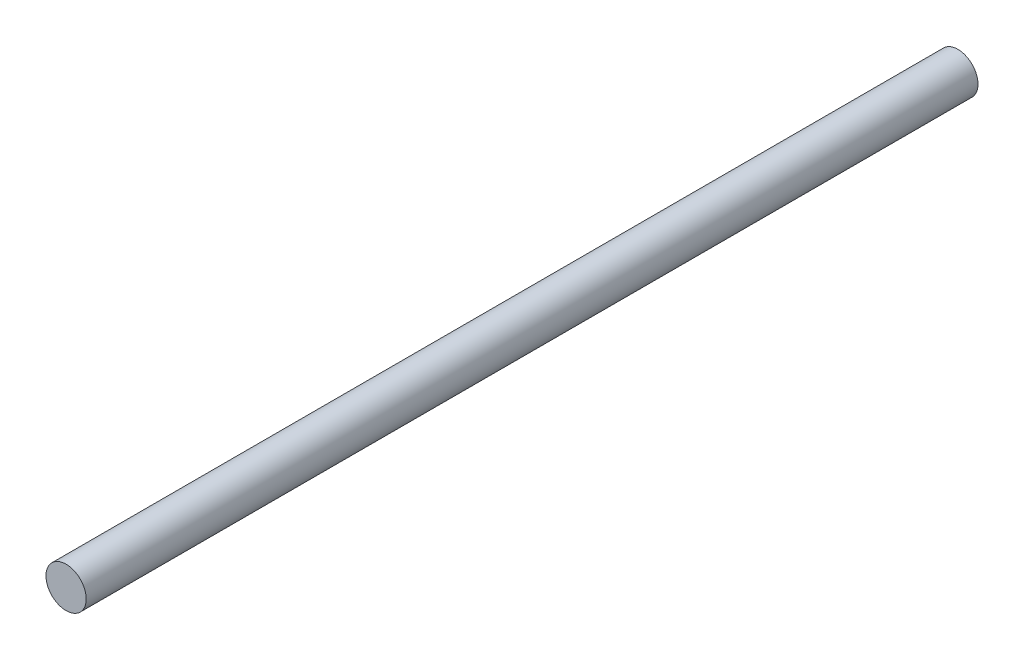
ISO-10303-21;
HEADER;
FILE_DESCRIPTION(('STEP AP214'),'2;1');
FILE_NAME('part.step','',(''),(''),'','','');
FILE_SCHEMA(('AUTOMOTIVE_DESIGN { 1 0 10303 214 1 1 1 1 }'));
ENDSEC;
DATA;
#1=APPLICATION_CONTEXT('core data for automotive mechanical design processes');
#2=APPLICATION_PROTOCOL_DEFINITION('international standard','automotive_design',2000,#1);
#3=PRODUCT_CONTEXT('',#1,'mechanical');
#4=PRODUCT('Part','Part','',(#3));
#5=PRODUCT_RELATED_PRODUCT_CATEGORY('part','',(#4));
#6=PRODUCT_DEFINITION_FORMATION('','',#4);
#7=PRODUCT_DEFINITION_CONTEXT('part definition',#1,'design');
#8=PRODUCT_DEFINITION('design','',#6,#7);
#9=PRODUCT_DEFINITION_SHAPE('','',#8);
#10=(LENGTH_UNIT() NAMED_UNIT(*) SI_UNIT(.MILLI.,.METRE.));
#11=(NAMED_UNIT(*) PLANE_ANGLE_UNIT() SI_UNIT($,.RADIAN.));
#12=(NAMED_UNIT(*) SI_UNIT($,.STERADIAN.) SOLID_ANGLE_UNIT());
#13=UNCERTAINTY_MEASURE_WITH_UNIT(LENGTH_MEASURE(1.E-05),#10,'distance_accuracy_value','');
#14=(GEOMETRIC_REPRESENTATION_CONTEXT(3) GLOBAL_UNCERTAINTY_ASSIGNED_CONTEXT((#13)) GLOBAL_UNIT_ASSIGNED_CONTEXT((#10,
#11,#12)) REPRESENTATION_CONTEXT('',''));
#15=CARTESIAN_POINT('',(0.,0.,0.));
#16=DIRECTION('',(0.,0.,1.));
#17=DIRECTION('',(1.,0.,0.));
#18=AXIS2_PLACEMENT_3D('',#15,#16,#17);
#19=CARTESIAN_POINT('',(0.,0.,350.));
#20=DIRECTION('',(0.,0.,-1.));
#21=DIRECTION('',(-1.,0.,0.));
#22=AXIS2_PLACEMENT_3D('',#19,#20,#21);
#23=CYLINDRICAL_SURFACE('',#22,7.9);
#24=CARTESIAN_POINT('',(0.,0.,350.));
#25=DIRECTION('',(0.,0.,1.));
#26=DIRECTION('',(1.,0.,0.));
#27=AXIS2_PLACEMENT_3D('',#24,#25,#26);
#28=CIRCLE('',#27,7.9);
#29=CARTESIAN_POINT('',(7.9,0.,350.));
#30=VERTEX_POINT('',#29);
#31=EDGE_CURVE('E10',#30,#30,#28,.T.);
#32=ORIENTED_EDGE('',*,*,#31,.F.);
#33=EDGE_LOOP('',(#32));
#34=FACE_BOUND('',#33,.T.);
#35=CARTESIAN_POINT('',(0.,0.,0.));
#36=DIRECTION('',(0.,0.,1.));
#37=DIRECTION('',(1.,0.,0.));
#38=AXIS2_PLACEMENT_3D('',#35,#36,#37);
#39=CIRCLE('',#38,7.9);
#40=CARTESIAN_POINT('',(7.9,0.,0.));
#41=VERTEX_POINT('',#40);
#42=EDGE_CURVE('E34',#41,#41,#39,.T.);
#43=ORIENTED_EDGE('',*,*,#42,.T.);
#44=EDGE_LOOP('',(#43));
#45=FACE_BOUND('',#44,.T.);
#46=ADVANCED_FACE('F31',(#34,#45),#23,.T.);
#47=CARTESIAN_POINT('',(0.,0.,350.));
#48=DIRECTION('',(0.,0.,1.));
#49=DIRECTION('',(1.,0.,0.));
#50=AXIS2_PLACEMENT_3D('',#47,#48,#49);
#51=PLANE('',#50);
#52=ORIENTED_EDGE('',*,*,#31,.T.);
#53=EDGE_LOOP('',(#52));
#54=FACE_BOUND('',#53,.T.);
#55=ADVANCED_FACE('F46',(#54),#51,.T.);
#56=CARTESIAN_POINT('',(0.,0.,0.));
#57=DIRECTION('',(0.,0.,1.));
#58=DIRECTION('',(1.,0.,0.));
#59=AXIS2_PLACEMENT_3D('',#56,#57,#58);
#60=PLANE('',#59);
#61=ORIENTED_EDGE('',*,*,#42,.F.);
#62=EDGE_LOOP('',(#61));
#63=FACE_BOUND('',#62,.T.);
#64=ADVANCED_FACE('F44',(#63),#60,.F.);
#65=CLOSED_SHELL('',(#46,#55,#64));
#66=MANIFOLD_SOLID_BREP('B2',#65);
#67=ADVANCED_BREP_SHAPE_REPRESENTATION('',(#18,#66),#14);
#68=SHAPE_DEFINITION_REPRESENTATION(#9,#67);
ENDSEC;
END-ISO-10303-21;
